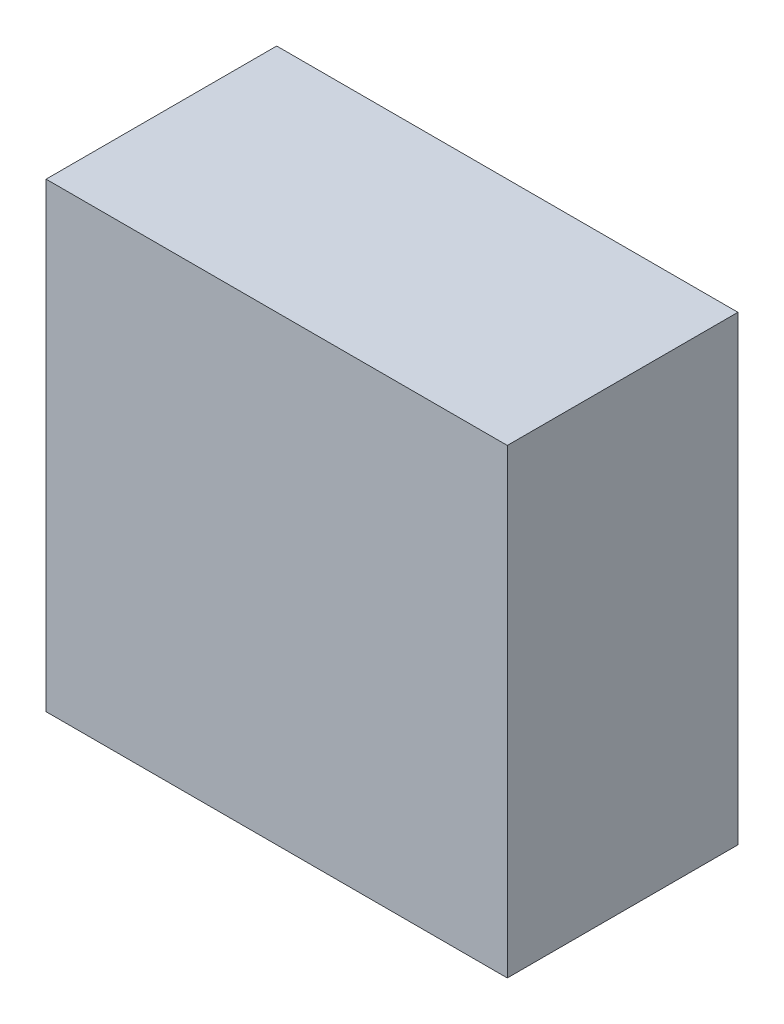
ISO-10303-21;
HEADER;
FILE_DESCRIPTION(('STEP AP214'),'2;1');
FILE_NAME('part.step','',(''),(''),'','','');
FILE_SCHEMA(('AUTOMOTIVE_DESIGN { 1 0 10303 214 1 1 1 1 }'));
ENDSEC;
DATA;
#1=APPLICATION_CONTEXT('core data for automotive mechanical design processes');
#2=APPLICATION_PROTOCOL_DEFINITION('international standard','automotive_design',2000,#1);
#3=PRODUCT_CONTEXT('',#1,'mechanical');
#4=PRODUCT('Part','Part','',(#3));
#5=PRODUCT_RELATED_PRODUCT_CATEGORY('part','',(#4));
#6=PRODUCT_DEFINITION_FORMATION('','',#4);
#7=PRODUCT_DEFINITION_CONTEXT('part definition',#1,'design');
#8=PRODUCT_DEFINITION('design','',#6,#7);
#9=PRODUCT_DEFINITION_SHAPE('','',#8);
#10=(LENGTH_UNIT() NAMED_UNIT(*) SI_UNIT(.MILLI.,.METRE.));
#11=(NAMED_UNIT(*) PLANE_ANGLE_UNIT() SI_UNIT($,.RADIAN.));
#12=(NAMED_UNIT(*) SI_UNIT($,.STERADIAN.) SOLID_ANGLE_UNIT());
#13=UNCERTAINTY_MEASURE_WITH_UNIT(LENGTH_MEASURE(1.E-05),#10,'distance_accuracy_value','');
#14=(GEOMETRIC_REPRESENTATION_CONTEXT(3) GLOBAL_UNCERTAINTY_ASSIGNED_CONTEXT((#13)) GLOBAL_UNIT_ASSIGNED_CONTEXT((#10,
#11,#12)) REPRESENTATION_CONTEXT('',''));
#15=CARTESIAN_POINT('',(0.,0.,0.));
#16=DIRECTION('',(0.,0.,1.));
#17=DIRECTION('',(1.,0.,0.));
#18=AXIS2_PLACEMENT_3D('',#15,#16,#17);
#19=CARTESIAN_POINT('',(0.,0.,2.75));
#20=DIRECTION('',(0.,0.,-1.));
#21=DIRECTION('',(-1.,0.,0.));
#22=AXIS2_PLACEMENT_3D('',#19,#20,#21);
#23=PLANE('',#22);
#24=DIRECTION('',(1.,0.,0.));
#25=VECTOR('',#24,1.);
#26=CARTESIAN_POINT('',(158.313158045852,-87.0708841556956,2.75));
#27=LINE('',#26,#25);
#28=CARTESIAN_POINT('',(158.313158045852,-87.0708841556956,2.75));
#29=VERTEX_POINT('',#28);
#30=CARTESIAN_POINT('',(154.313158045852,-87.0708841556956,2.75));
#31=VERTEX_POINT('',#30);
#32=EDGE_CURVE('E80',#29,#31,#27,.F.);
#33=ORIENTED_EDGE('',*,*,#32,.T.);
#34=DIRECTION('',(0.,1.,0.));
#35=VECTOR('',#34,1.);
#36=CARTESIAN_POINT('',(154.313158045852,-87.0708841556956,2.75));
#37=LINE('',#36,#35);
#38=CARTESIAN_POINT('',(154.313158045852,-91.0708841556956,2.75));
#39=VERTEX_POINT('',#38);
#40=EDGE_CURVE('E55',#31,#39,#37,.F.);
#41=ORIENTED_EDGE('',*,*,#40,.T.);
#42=DIRECTION('',(1.,0.,0.));
#43=VECTOR('',#42,1.);
#44=CARTESIAN_POINT('',(158.313158045852,-91.0708841556956,2.75));
#45=LINE('',#44,#43);
#46=CARTESIAN_POINT('',(158.313158045852,-91.0708841556956,2.75));
#47=VERTEX_POINT('',#46);
#48=EDGE_CURVE('E57',#39,#47,#45,.T.);
#49=ORIENTED_EDGE('',*,*,#48,.T.);
#50=DIRECTION('',(0.,1.,0.));
#51=VECTOR('',#50,1.);
#52=CARTESIAN_POINT('',(158.313158045852,-87.0708841556956,2.75));
#53=LINE('',#52,#51);
#54=EDGE_CURVE('E20',#47,#29,#53,.T.);
#55=ORIENTED_EDGE('',*,*,#54,.T.);
#56=EDGE_LOOP('',(#33,#41,#49,#55));
#57=FACE_BOUND('',#56,.T.);
#58=ADVANCED_FACE('F17',(#57),#23,.F.);
#59=CARTESIAN_POINT('',(158.313158045852,-87.0708841556956,2.75));
#60=DIRECTION('',(-1.,0.,0.));
#61=DIRECTION('',(0.,0.,1.));
#62=AXIS2_PLACEMENT_3D('',#59,#60,#61);
#63=PLANE('',#62);
#64=DIRECTION('',(0.,0.,-1.));
#65=VECTOR('',#64,1.);
#66=CARTESIAN_POINT('',(158.313158045852,-87.0708841556956,2.75));
#67=LINE('',#66,#65);
#68=CARTESIAN_POINT('',(158.313158045852,-87.0708841556956,0.75));
#69=VERTEX_POINT('',#68);
#70=EDGE_CURVE('E68',#69,#29,#67,.F.);
#71=ORIENTED_EDGE('',*,*,#70,.T.);
#72=ORIENTED_EDGE('',*,*,#54,.F.);
#73=DIRECTION('',(0.,0.,1.));
#74=VECTOR('',#73,1.);
#75=CARTESIAN_POINT('',(158.313158045852,-91.0708841556956,2.75));
#76=LINE('',#75,#74);
#77=CARTESIAN_POINT('',(158.313158045852,-91.0708841556956,0.75));
#78=VERTEX_POINT('',#77);
#79=EDGE_CURVE('E63',#47,#78,#76,.F.);
#80=ORIENTED_EDGE('',*,*,#79,.T.);
#81=DIRECTION('',(0.,1.,0.));
#82=VECTOR('',#81,1.);
#83=CARTESIAN_POINT('',(158.313158045852,0.,0.75));
#84=LINE('',#83,#82);
#85=EDGE_CURVE('E83',#69,#78,#84,.F.);
#86=ORIENTED_EDGE('',*,*,#85,.F.);
#87=EDGE_LOOP('',(#71,#72,#80,#86));
#88=FACE_BOUND('',#87,.T.);
#89=ADVANCED_FACE('F65',(#88),#63,.F.);
#90=CARTESIAN_POINT('',(158.313158045852,-91.0708841556956,2.75));
#91=DIRECTION('',(0.,1.,0.));
#92=DIRECTION('',(0.,0.,1.));
#93=AXIS2_PLACEMENT_3D('',#90,#91,#92);
#94=PLANE('',#93);
#95=ORIENTED_EDGE('',*,*,#79,.F.);
#96=ORIENTED_EDGE('',*,*,#48,.F.);
#97=DIRECTION('',(0.,0.,-1.));
#98=VECTOR('',#97,1.);
#99=CARTESIAN_POINT('',(154.313158045852,-91.0708841556956,2.75));
#100=LINE('',#99,#98);
#101=CARTESIAN_POINT('',(154.313158045852,-91.0708841556956,0.75));
#102=VERTEX_POINT('',#101);
#103=EDGE_CURVE('E75',#39,#102,#100,.T.);
#104=ORIENTED_EDGE('',*,*,#103,.T.);
#105=DIRECTION('',(-1.,0.,0.));
#106=VECTOR('',#105,1.);
#107=CARTESIAN_POINT('',(0.,-91.0708841556956,0.75));
#108=LINE('',#107,#106);
#109=EDGE_CURVE('E72',#78,#102,#108,.T.);
#110=ORIENTED_EDGE('',*,*,#109,.F.);
#111=EDGE_LOOP('',(#95,#96,#104,#110));
#112=FACE_BOUND('',#111,.T.);
#113=ADVANCED_FACE('F70',(#112),#94,.F.);
#114=CARTESIAN_POINT('',(154.313158045852,-87.0708841556956,2.75));
#115=DIRECTION('',(1.,0.,0.));
#116=DIRECTION('',(0.,0.,-1.));
#117=AXIS2_PLACEMENT_3D('',#114,#115,#116);
#118=PLANE('',#117);
#119=ORIENTED_EDGE('',*,*,#103,.F.);
#120=ORIENTED_EDGE('',*,*,#40,.F.);
#121=DIRECTION('',(0.,0.,-1.));
#122=VECTOR('',#121,1.);
#123=CARTESIAN_POINT('',(154.313158045852,-87.0708841556956,2.75));
#124=LINE('',#123,#122);
#125=CARTESIAN_POINT('',(154.313158045852,-87.0708841556956,0.75));
#126=VERTEX_POINT('',#125);
#127=EDGE_CURVE('E35',#31,#126,#124,.T.);
#128=ORIENTED_EDGE('',*,*,#127,.T.);
#129=DIRECTION('',(0.,1.,0.));
#130=VECTOR('',#129,1.);
#131=CARTESIAN_POINT('',(154.313158045852,0.,0.75));
#132=LINE('',#131,#130);
#133=EDGE_CURVE('E26',#102,#126,#132,.T.);
#134=ORIENTED_EDGE('',*,*,#133,.F.);
#135=EDGE_LOOP('',(#119,#120,#128,#134));
#136=FACE_BOUND('',#135,.T.);
#137=ADVANCED_FACE('F89',(#136),#118,.F.);
#138=CARTESIAN_POINT('',(158.313158045852,-87.0708841556956,2.75));
#139=DIRECTION('',(0.,-1.,0.));
#140=DIRECTION('',(0.,0.,-1.));
#141=AXIS2_PLACEMENT_3D('',#138,#139,#140);
#142=PLANE('',#141);
#143=ORIENTED_EDGE('',*,*,#127,.F.);
#144=ORIENTED_EDGE('',*,*,#32,.F.);
#145=ORIENTED_EDGE('',*,*,#70,.F.);
#146=DIRECTION('',(-1.,0.,0.));
#147=VECTOR('',#146,1.);
#148=CARTESIAN_POINT('',(0.,-87.0708841556956,0.75));
#149=LINE('',#148,#147);
#150=EDGE_CURVE('E11',#126,#69,#149,.F.);
#151=ORIENTED_EDGE('',*,*,#150,.F.);
#152=EDGE_LOOP('',(#143,#144,#145,#151));
#153=FACE_BOUND('',#152,.T.);
#154=ADVANCED_FACE('F91',(#153),#142,.F.);
#155=CARTESIAN_POINT('',(0.,0.,0.75));
#156=DIRECTION('',(0.,0.,-1.));
#157=DIRECTION('',(-1.,0.,0.));
#158=AXIS2_PLACEMENT_3D('',#155,#156,#157);
#159=PLANE('',#158);
#160=ORIENTED_EDGE('',*,*,#133,.T.);
#161=ORIENTED_EDGE('',*,*,#150,.T.);
#162=ORIENTED_EDGE('',*,*,#85,.T.);
#163=ORIENTED_EDGE('',*,*,#109,.T.);
#164=EDGE_LOOP('',(#160,#161,#162,#163));
#165=FACE_BOUND('',#164,.T.);
#166=ADVANCED_FACE('F88',(#165),#159,.T.);
#167=CLOSED_SHELL('',(#58,#89,#113,#137,#154,#166));
#168=MANIFOLD_SOLID_BREP('B1',#167);
#169=ADVANCED_BREP_SHAPE_REPRESENTATION('',(#18,#168),#14);
#170=SHAPE_DEFINITION_REPRESENTATION(#9,#169);
ENDSEC;
END-ISO-10303-21;
